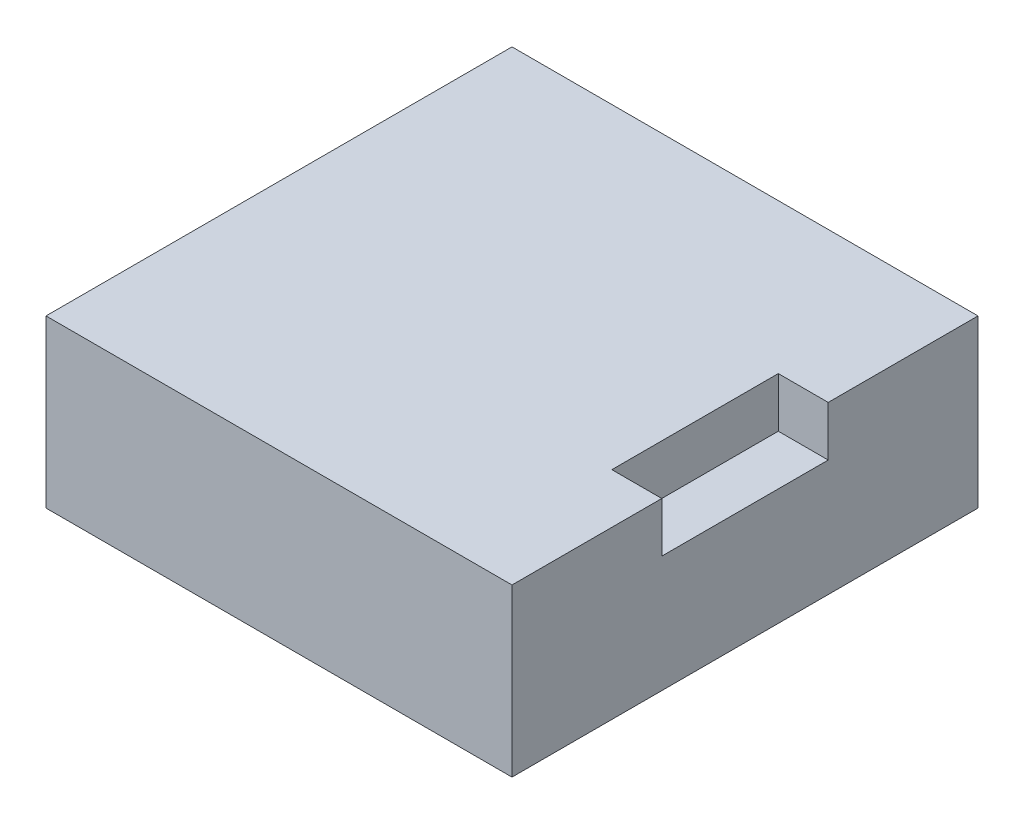
ISO-10303-21;
HEADER;
FILE_DESCRIPTION(('STEP AP214'),'2;1');
FILE_NAME('part.step','',(''),(''),'','','');
FILE_SCHEMA(('AUTOMOTIVE_DESIGN { 1 0 10303 214 1 1 1 1 }'));
ENDSEC;
DATA;
#1=APPLICATION_CONTEXT('core data for automotive mechanical design processes');
#2=APPLICATION_PROTOCOL_DEFINITION('international standard','automotive_design',2000,#1);
#3=PRODUCT_CONTEXT('',#1,'mechanical');
#4=PRODUCT('Part','Part','',(#3));
#5=PRODUCT_RELATED_PRODUCT_CATEGORY('part','',(#4));
#6=PRODUCT_DEFINITION_FORMATION('','',#4);
#7=PRODUCT_DEFINITION_CONTEXT('part definition',#1,'design');
#8=PRODUCT_DEFINITION('design','',#6,#7);
#9=PRODUCT_DEFINITION_SHAPE('','',#8);
#10=(LENGTH_UNIT() NAMED_UNIT(*) SI_UNIT(.MILLI.,.METRE.));
#11=(NAMED_UNIT(*) PLANE_ANGLE_UNIT() SI_UNIT($,.RADIAN.));
#12=(NAMED_UNIT(*) SI_UNIT($,.STERADIAN.) SOLID_ANGLE_UNIT());
#13=UNCERTAINTY_MEASURE_WITH_UNIT(LENGTH_MEASURE(1.E-05),#10,'distance_accuracy_value','');
#14=(GEOMETRIC_REPRESENTATION_CONTEXT(3) GLOBAL_UNCERTAINTY_ASSIGNED_CONTEXT((#13)) GLOBAL_UNIT_ASSIGNED_CONTEXT((#10,
#11,#12)) REPRESENTATION_CONTEXT('',''));
#15=CARTESIAN_POINT('',(0.,0.,0.));
#16=DIRECTION('',(0.,0.,1.));
#17=DIRECTION('',(1.,0.,0.));
#18=AXIS2_PLACEMENT_3D('',#15,#16,#17);
#19=CARTESIAN_POINT('',(14.,5.,14.));
#20=DIRECTION('',(-1.,0.,0.));
#21=DIRECTION('',(0.,0.,1.));
#22=AXIS2_PLACEMENT_3D('',#19,#20,#21);
#23=PLANE('',#22);
#24=DIRECTION('',(0.,1.,0.));
#25=VECTOR('',#24,1.);
#26=CARTESIAN_POINT('',(14.,2.,-5.));
#27=LINE('',#26,#25);
#28=CARTESIAN_POINT('',(14.,2.,-5.));
#29=VERTEX_POINT('',#28);
#30=CARTESIAN_POINT('',(14.,5.,-5.));
#31=VERTEX_POINT('',#30);
#32=EDGE_CURVE('E124',#29,#31,#27,.T.);
#33=ORIENTED_EDGE('',*,*,#32,.F.);
#34=DIRECTION('',(0.,0.,1.));
#35=VECTOR('',#34,1.);
#36=CARTESIAN_POINT('',(14.,2.,-5.));
#37=LINE('',#36,#35);
#38=CARTESIAN_POINT('',(14.,2.,5.));
#39=VERTEX_POINT('',#38);
#40=EDGE_CURVE('E133',#29,#39,#37,.T.);
#41=ORIENTED_EDGE('',*,*,#40,.T.);
#42=DIRECTION('',(0.,1.,0.));
#43=VECTOR('',#42,1.);
#44=CARTESIAN_POINT('',(14.,2.,5.));
#45=LINE('',#44,#43);
#46=CARTESIAN_POINT('',(14.,5.,5.));
#47=VERTEX_POINT('',#46);
#48=EDGE_CURVE('E127',#39,#47,#45,.T.);
#49=ORIENTED_EDGE('',*,*,#48,.T.);
#50=DIRECTION('',(0.,0.,-1.));
#51=VECTOR('',#50,1.);
#52=CARTESIAN_POINT('',(14.,5.,14.));
#53=LINE('',#52,#51);
#54=CARTESIAN_POINT('',(14.,5.,14.));
#55=VERTEX_POINT('',#54);
#56=EDGE_CURVE('E144',#55,#47,#53,.T.);
#57=ORIENTED_EDGE('',*,*,#56,.F.);
#58=DIRECTION('',(0.,-1.,0.));
#59=VECTOR('',#58,1.);
#60=CARTESIAN_POINT('',(14.,5.,14.));
#61=LINE('',#60,#59);
#62=CARTESIAN_POINT('',(14.,-5.,14.));
#63=VERTEX_POINT('',#62);
#64=EDGE_CURVE('E45',#55,#63,#61,.T.);
#65=ORIENTED_EDGE('',*,*,#64,.T.);
#66=DIRECTION('',(0.,0.,-1.));
#67=VECTOR('',#66,1.);
#68=CARTESIAN_POINT('',(14.,-5.,14.));
#69=LINE('',#68,#67);
#70=CARTESIAN_POINT('',(14.,-5.,-14.));
#71=VERTEX_POINT('',#70);
#72=EDGE_CURVE('E154',#63,#71,#69,.T.);
#73=ORIENTED_EDGE('',*,*,#72,.T.);
#74=DIRECTION('',(0.,-1.,0.));
#75=VECTOR('',#74,1.);
#76=CARTESIAN_POINT('',(14.,5.,-14.));
#77=LINE('',#76,#75);
#78=CARTESIAN_POINT('',(14.,5.,-14.));
#79=VERTEX_POINT('',#78);
#80=EDGE_CURVE('E159',#79,#71,#77,.T.);
#81=ORIENTED_EDGE('',*,*,#80,.F.);
#82=EDGE_CURVE('E143',#31,#79,#53,.T.);
#83=ORIENTED_EDGE('',*,*,#82,.F.);
#84=EDGE_LOOP('',(#33,#41,#49,#57,#65,#73,#81,#83));
#85=FACE_BOUND('',#84,.T.);
#86=ADVANCED_FACE('F36',(#85),#23,.F.);
#87=CARTESIAN_POINT('',(0.,5.,0.));
#88=DIRECTION('',(0.,-1.,0.));
#89=DIRECTION('',(0.,0.,-1.));
#90=AXIS2_PLACEMENT_3D('',#87,#88,#89);
#91=PLANE('',#90);
#92=DIRECTION('',(-1.,0.,0.));
#93=VECTOR('',#92,1.);
#94=CARTESIAN_POINT('',(14.,5.,-5.));
#95=LINE('',#94,#93);
#96=CARTESIAN_POINT('',(11.,5.,-5.));
#97=VERTEX_POINT('',#96);
#98=EDGE_CURVE('E119',#31,#97,#95,.T.);
#99=ORIENTED_EDGE('',*,*,#98,.F.);
#100=ORIENTED_EDGE('',*,*,#82,.T.);
#101=DIRECTION('',(1.,0.,0.));
#102=VECTOR('',#101,1.);
#103=CARTESIAN_POINT('',(-14.,5.,-14.));
#104=LINE('',#103,#102);
#105=CARTESIAN_POINT('',(-14.,5.,-14.));
#106=VERTEX_POINT('',#105);
#107=EDGE_CURVE('E140',#106,#79,#104,.T.);
#108=ORIENTED_EDGE('',*,*,#107,.F.);
#109=DIRECTION('',(0.,0.,-1.));
#110=VECTOR('',#109,1.);
#111=CARTESIAN_POINT('',(-14.,5.,14.));
#112=LINE('',#111,#110);
#113=CARTESIAN_POINT('',(-14.,5.,14.));
#114=VERTEX_POINT('',#113);
#115=EDGE_CURVE('E138',#114,#106,#112,.T.);
#116=ORIENTED_EDGE('',*,*,#115,.F.);
#117=DIRECTION('',(1.,0.,0.));
#118=VECTOR('',#117,1.);
#119=CARTESIAN_POINT('',(-14.,5.,14.));
#120=LINE('',#119,#118);
#121=EDGE_CURVE('E146',#114,#55,#120,.T.);
#122=ORIENTED_EDGE('',*,*,#121,.T.);
#123=ORIENTED_EDGE('',*,*,#56,.T.);
#124=DIRECTION('',(-1.,0.,0.));
#125=VECTOR('',#124,1.);
#126=CARTESIAN_POINT('',(14.,5.,5.));
#127=LINE('',#126,#125);
#128=CARTESIAN_POINT('',(11.,5.,5.));
#129=VERTEX_POINT('',#128);
#130=EDGE_CURVE('E131',#47,#129,#127,.T.);
#131=ORIENTED_EDGE('',*,*,#130,.T.);
#132=DIRECTION('',(0.,0.,1.));
#133=VECTOR('',#132,1.);
#134=CARTESIAN_POINT('',(11.,5.,-5.));
#135=LINE('',#134,#133);
#136=EDGE_CURVE('E112',#97,#129,#135,.T.);
#137=ORIENTED_EDGE('',*,*,#136,.F.);
#138=EDGE_LOOP('',(#99,#100,#108,#116,#122,#123,#131,#137));
#139=FACE_BOUND('',#138,.T.);
#140=ADVANCED_FACE('F129',(#139),#91,.F.);
#141=CARTESIAN_POINT('',(-14.,5.,14.));
#142=DIRECTION('',(-1.,0.,0.));
#143=DIRECTION('',(0.,0.,1.));
#144=AXIS2_PLACEMENT_3D('',#141,#142,#143);
#145=PLANE('',#144);
#146=DIRECTION('',(0.,0.,-1.));
#147=VECTOR('',#146,1.);
#148=CARTESIAN_POINT('',(-14.,-5.,14.));
#149=LINE('',#148,#147);
#150=CARTESIAN_POINT('',(-14.,-5.,14.));
#151=VERTEX_POINT('',#150);
#152=CARTESIAN_POINT('',(-14.,-5.,-14.));
#153=VERTEX_POINT('',#152);
#154=EDGE_CURVE('E148',#151,#153,#149,.T.);
#155=ORIENTED_EDGE('',*,*,#154,.F.);
#156=DIRECTION('',(0.,-1.,0.));
#157=VECTOR('',#156,1.);
#158=CARTESIAN_POINT('',(-14.,5.,14.));
#159=LINE('',#158,#157);
#160=EDGE_CURVE('E11',#114,#151,#159,.T.);
#161=ORIENTED_EDGE('',*,*,#160,.F.);
#162=ORIENTED_EDGE('',*,*,#115,.T.);
#163=DIRECTION('',(0.,-1.,0.));
#164=VECTOR('',#163,1.);
#165=CARTESIAN_POINT('',(-14.,5.,-14.));
#166=LINE('',#165,#164);
#167=EDGE_CURVE('E40',#106,#153,#166,.T.);
#168=ORIENTED_EDGE('',*,*,#167,.T.);
#169=EDGE_LOOP('',(#155,#161,#162,#168));
#170=FACE_BOUND('',#169,.T.);
#171=ADVANCED_FACE('F38',(#170),#145,.T.);
#172=CARTESIAN_POINT('',(-14.,5.,14.));
#173=DIRECTION('',(0.,0.,-1.));
#174=DIRECTION('',(-1.,0.,0.));
#175=AXIS2_PLACEMENT_3D('',#172,#173,#174);
#176=PLANE('',#175);
#177=DIRECTION('',(1.,0.,0.));
#178=VECTOR('',#177,1.);
#179=CARTESIAN_POINT('',(-14.,-5.,14.));
#180=LINE('',#179,#178);
#181=EDGE_CURVE('E141',#151,#63,#180,.T.);
#182=ORIENTED_EDGE('',*,*,#181,.T.);
#183=ORIENTED_EDGE('',*,*,#64,.F.);
#184=ORIENTED_EDGE('',*,*,#121,.F.);
#185=ORIENTED_EDGE('',*,*,#160,.T.);
#186=EDGE_LOOP('',(#182,#183,#184,#185));
#187=FACE_BOUND('',#186,.T.);
#188=ADVANCED_FACE('F167',(#187),#176,.F.);
#189=CARTESIAN_POINT('',(-14.,5.,-14.));
#190=DIRECTION('',(0.,0.,-1.));
#191=DIRECTION('',(-1.,0.,0.));
#192=AXIS2_PLACEMENT_3D('',#189,#190,#191);
#193=PLANE('',#192);
#194=DIRECTION('',(1.,0.,0.));
#195=VECTOR('',#194,1.);
#196=CARTESIAN_POINT('',(-14.,-5.,-14.));
#197=LINE('',#196,#195);
#198=EDGE_CURVE('E151',#153,#71,#197,.T.);
#199=ORIENTED_EDGE('',*,*,#198,.F.);
#200=ORIENTED_EDGE('',*,*,#167,.F.);
#201=ORIENTED_EDGE('',*,*,#107,.T.);
#202=ORIENTED_EDGE('',*,*,#80,.T.);
#203=EDGE_LOOP('',(#199,#200,#201,#202));
#204=FACE_BOUND('',#203,.T.);
#205=ADVANCED_FACE('F162',(#204),#193,.T.);
#206=CARTESIAN_POINT('',(0.,-5.,0.));
#207=DIRECTION('',(0.,-1.,0.));
#208=DIRECTION('',(0.,0.,-1.));
#209=AXIS2_PLACEMENT_3D('',#206,#207,#208);
#210=PLANE('',#209);
#211=ORIENTED_EDGE('',*,*,#154,.T.);
#212=ORIENTED_EDGE('',*,*,#198,.T.);
#213=ORIENTED_EDGE('',*,*,#72,.F.);
#214=ORIENTED_EDGE('',*,*,#181,.F.);
#215=EDGE_LOOP('',(#211,#212,#213,#214));
#216=FACE_BOUND('',#215,.T.);
#217=ADVANCED_FACE('F165',(#216),#210,.T.);
#218=CARTESIAN_POINT('',(11.,2.,-5.));
#219=DIRECTION('',(0.,-1.,0.));
#220=DIRECTION('',(0.,0.,-1.));
#221=AXIS2_PLACEMENT_3D('',#218,#219,#220);
#222=PLANE('',#221);
#223=DIRECTION('',(1.,0.,0.));
#224=VECTOR('',#223,1.);
#225=CARTESIAN_POINT('',(11.,2.,5.));
#226=LINE('',#225,#224);
#227=CARTESIAN_POINT('',(11.,2.,5.));
#228=VERTEX_POINT('',#227);
#229=EDGE_CURVE('E176',#228,#39,#226,.T.);
#230=ORIENTED_EDGE('',*,*,#229,.T.);
#231=ORIENTED_EDGE('',*,*,#40,.F.);
#232=DIRECTION('',(1.,0.,0.));
#233=VECTOR('',#232,1.);
#234=CARTESIAN_POINT('',(11.,2.,-5.));
#235=LINE('',#234,#233);
#236=CARTESIAN_POINT('',(11.,2.,-5.));
#237=VERTEX_POINT('',#236);
#238=EDGE_CURVE('E118',#237,#29,#235,.T.);
#239=ORIENTED_EDGE('',*,*,#238,.F.);
#240=DIRECTION('',(0.,0.,1.));
#241=VECTOR('',#240,1.);
#242=CARTESIAN_POINT('',(11.,2.,-5.));
#243=LINE('',#242,#241);
#244=EDGE_CURVE('E114',#237,#228,#243,.T.);
#245=ORIENTED_EDGE('',*,*,#244,.T.);
#246=EDGE_LOOP('',(#230,#231,#239,#245));
#247=FACE_BOUND('',#246,.T.);
#248=ADVANCED_FACE('F180',(#247),#222,.F.);
#249=CARTESIAN_POINT('',(11.,5.,-5.));
#250=DIRECTION('',(-1.,0.,0.));
#251=DIRECTION('',(0.,0.,1.));
#252=AXIS2_PLACEMENT_3D('',#249,#250,#251);
#253=PLANE('',#252);
#254=DIRECTION('',(0.,-1.,0.));
#255=VECTOR('',#254,1.);
#256=CARTESIAN_POINT('',(11.,5.,5.));
#257=LINE('',#256,#255);
#258=EDGE_CURVE('E53',#129,#228,#257,.T.);
#259=ORIENTED_EDGE('',*,*,#258,.T.);
#260=ORIENTED_EDGE('',*,*,#244,.F.);
#261=DIRECTION('',(0.,-1.,0.));
#262=VECTOR('',#261,1.);
#263=CARTESIAN_POINT('',(11.,5.,-5.));
#264=LINE('',#263,#262);
#265=EDGE_CURVE('E108',#97,#237,#264,.T.);
#266=ORIENTED_EDGE('',*,*,#265,.F.);
#267=ORIENTED_EDGE('',*,*,#136,.T.);
#268=EDGE_LOOP('',(#259,#260,#266,#267));
#269=FACE_BOUND('',#268,.T.);
#270=ADVANCED_FACE('F110',(#269),#253,.F.);
#271=CARTESIAN_POINT('',(0.,0.,-5.));
#272=DIRECTION('',(0.,0.,1.));
#273=DIRECTION('',(1.,0.,0.));
#274=AXIS2_PLACEMENT_3D('',#271,#272,#273);
#275=PLANE('',#274);
#276=ORIENTED_EDGE('',*,*,#98,.T.);
#277=ORIENTED_EDGE('',*,*,#265,.T.);
#278=ORIENTED_EDGE('',*,*,#238,.T.);
#279=ORIENTED_EDGE('',*,*,#32,.T.);
#280=EDGE_LOOP('',(#276,#277,#278,#279));
#281=FACE_BOUND('',#280,.T.);
#282=ADVANCED_FACE('F122',(#281),#275,.T.);
#283=CARTESIAN_POINT('',(0.,0.,5.));
#284=DIRECTION('',(0.,0.,1.));
#285=DIRECTION('',(1.,0.,0.));
#286=AXIS2_PLACEMENT_3D('',#283,#284,#285);
#287=PLANE('',#286);
#288=ORIENTED_EDGE('',*,*,#130,.F.);
#289=ORIENTED_EDGE('',*,*,#48,.F.);
#290=ORIENTED_EDGE('',*,*,#229,.F.);
#291=ORIENTED_EDGE('',*,*,#258,.F.);
#292=EDGE_LOOP('',(#288,#289,#290,#291));
#293=FACE_BOUND('',#292,.T.);
#294=ADVANCED_FACE('F181',(#293),#287,.F.);
#295=CLOSED_SHELL('',(#86,#140,#171,#188,#205,#217,#248,#270,#282,#294));
#296=MANIFOLD_SOLID_BREP('B2',#295);
#297=ADVANCED_BREP_SHAPE_REPRESENTATION('',(#18,#296),#14);
#298=SHAPE_DEFINITION_REPRESENTATION(#9,#297);
ENDSEC;
END-ISO-10303-21;
